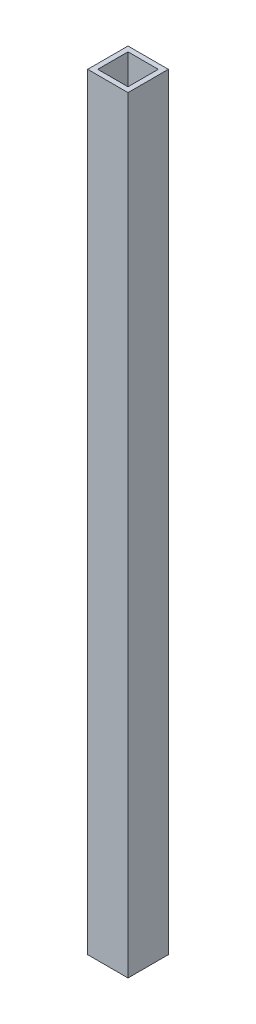
ISO-10303-21;
HEADER;
FILE_DESCRIPTION(('STEP AP214'),'2;1');
FILE_NAME('part.step','',(''),(''),'','','');
FILE_SCHEMA(('AUTOMOTIVE_DESIGN { 1 0 10303 214 1 1 1 1 }'));
ENDSEC;
DATA;
#1=APPLICATION_CONTEXT('core data for automotive mechanical design processes');
#2=APPLICATION_PROTOCOL_DEFINITION('international standard','automotive_design',2000,#1);
#3=PRODUCT_CONTEXT('',#1,'mechanical');
#4=PRODUCT('Part','Part','',(#3));
#5=PRODUCT_RELATED_PRODUCT_CATEGORY('part','',(#4));
#6=PRODUCT_DEFINITION_FORMATION('','',#4);
#7=PRODUCT_DEFINITION_CONTEXT('part definition',#1,'design');
#8=PRODUCT_DEFINITION('design','',#6,#7);
#9=PRODUCT_DEFINITION_SHAPE('','',#8);
#10=(LENGTH_UNIT() NAMED_UNIT(*) SI_UNIT(.MILLI.,.METRE.));
#11=(NAMED_UNIT(*) PLANE_ANGLE_UNIT() SI_UNIT($,.RADIAN.));
#12=(NAMED_UNIT(*) SI_UNIT($,.STERADIAN.) SOLID_ANGLE_UNIT());
#13=UNCERTAINTY_MEASURE_WITH_UNIT(LENGTH_MEASURE(1.E-05),#10,'distance_accuracy_value','');
#14=(GEOMETRIC_REPRESENTATION_CONTEXT(3) GLOBAL_UNCERTAINTY_ASSIGNED_CONTEXT((#13)) GLOBAL_UNIT_ASSIGNED_CONTEXT((#10,
#11,#12)) REPRESENTATION_CONTEXT('',''));
#15=CARTESIAN_POINT('',(0.,0.,0.));
#16=DIRECTION('',(0.,0.,1.));
#17=DIRECTION('',(1.,0.,0.));
#18=AXIS2_PLACEMENT_3D('',#15,#16,#17);
#19=CARTESIAN_POINT('',(-165.1,749.3,2104.59868564606));
#20=DIRECTION('',(-1.,0.,0.));
#21=DIRECTION('',(0.,0.,1.));
#22=AXIS2_PLACEMENT_3D('',#19,#20,#21);
#23=PLANE('',#22);
#24=DIRECTION('',(0.,0.,-1.));
#25=VECTOR('',#24,1.);
#26=CARTESIAN_POINT('',(-165.1,-215.9,2104.59868564606));
#27=LINE('',#26,#25);
#28=CARTESIAN_POINT('',(-165.1,-215.9,2133.6));
#29=VERTEX_POINT('',#28);
#30=CARTESIAN_POINT('',(-165.1,-215.9,2082.8));
#31=VERTEX_POINT('',#30);
#32=EDGE_CURVE('E155',#29,#31,#27,.T.);
#33=ORIENTED_EDGE('',*,*,#32,.T.);
#34=DIRECTION('',(0.,-1.,0.));
#35=VECTOR('',#34,1.);
#36=CARTESIAN_POINT('',(-165.1,749.3,2082.8));
#37=LINE('',#36,#35);
#38=CARTESIAN_POINT('',(-165.1,749.3,2082.8));
#39=VERTEX_POINT('',#38);
#40=EDGE_CURVE('E39',#39,#31,#37,.T.);
#41=ORIENTED_EDGE('',*,*,#40,.F.);
#42=DIRECTION('',(0.,0.,-1.));
#43=VECTOR('',#42,1.);
#44=CARTESIAN_POINT('',(-165.1,749.3,2104.59868564606));
#45=LINE('',#44,#43);
#46=CARTESIAN_POINT('',(-165.1,749.3,2133.6));
#47=VERTEX_POINT('',#46);
#48=EDGE_CURVE('E126',#47,#39,#45,.T.);
#49=ORIENTED_EDGE('',*,*,#48,.F.);
#50=DIRECTION('',(0.,-1.,0.));
#51=VECTOR('',#50,1.);
#52=CARTESIAN_POINT('',(-165.1,749.3,2133.6));
#53=LINE('',#52,#51);
#54=EDGE_CURVE('E9',#47,#29,#53,.T.);
#55=ORIENTED_EDGE('',*,*,#54,.T.);
#56=EDGE_LOOP('',(#33,#41,#49,#55));
#57=FACE_BOUND('',#56,.T.);
#58=ADVANCED_FACE('F14',(#57),#23,.F.);
#59=CARTESIAN_POINT('',(-190.5,749.3,2133.6));
#60=DIRECTION('',(0.,0.,-1.));
#61=DIRECTION('',(-1.,0.,0.));
#62=AXIS2_PLACEMENT_3D('',#59,#60,#61);
#63=PLANE('',#62);
#64=DIRECTION('',(1.,0.,0.));
#65=VECTOR('',#64,1.);
#66=CARTESIAN_POINT('',(-190.5,-215.9,2133.6));
#67=LINE('',#66,#65);
#68=CARTESIAN_POINT('',(-215.9,-215.9,2133.6));
#69=VERTEX_POINT('',#68);
#70=EDGE_CURVE('E158',#69,#29,#67,.T.);
#71=ORIENTED_EDGE('',*,*,#70,.T.);
#72=ORIENTED_EDGE('',*,*,#54,.F.);
#73=DIRECTION('',(1.,0.,0.));
#74=VECTOR('',#73,1.);
#75=CARTESIAN_POINT('',(-190.5,749.3,2133.6));
#76=LINE('',#75,#74);
#77=CARTESIAN_POINT('',(-215.9,749.3,2133.6));
#78=VERTEX_POINT('',#77);
#79=EDGE_CURVE('E121',#78,#47,#76,.T.);
#80=ORIENTED_EDGE('',*,*,#79,.F.);
#81=DIRECTION('',(0.,-1.,0.));
#82=VECTOR('',#81,1.);
#83=CARTESIAN_POINT('',(-215.9,749.3,2133.6));
#84=LINE('',#83,#82);
#85=EDGE_CURVE('E25',#78,#69,#84,.T.);
#86=ORIENTED_EDGE('',*,*,#85,.T.);
#87=EDGE_LOOP('',(#71,#72,#80,#86));
#88=FACE_BOUND('',#87,.T.);
#89=ADVANCED_FACE('F122',(#88),#63,.F.);
#90=CARTESIAN_POINT('',(-215.9,749.3,2104.59868564606));
#91=DIRECTION('',(1.,0.,0.));
#92=DIRECTION('',(0.,0.,-1.));
#93=AXIS2_PLACEMENT_3D('',#90,#91,#92);
#94=PLANE('',#93);
#95=DIRECTION('',(0.,0.,1.));
#96=VECTOR('',#95,1.);
#97=CARTESIAN_POINT('',(-215.9,-215.9,2104.59868564606));
#98=LINE('',#97,#96);
#99=CARTESIAN_POINT('',(-215.9,-215.9,2082.8));
#100=VERTEX_POINT('',#99);
#101=EDGE_CURVE('E114',#100,#69,#98,.T.);
#102=ORIENTED_EDGE('',*,*,#101,.T.);
#103=ORIENTED_EDGE('',*,*,#85,.F.);
#104=DIRECTION('',(0.,0.,1.));
#105=VECTOR('',#104,1.);
#106=CARTESIAN_POINT('',(-215.9,749.3,2104.59868564606));
#107=LINE('',#106,#105);
#108=CARTESIAN_POINT('',(-215.9,749.3,2082.8));
#109=VERTEX_POINT('',#108);
#110=EDGE_CURVE('E111',#109,#78,#107,.T.);
#111=ORIENTED_EDGE('',*,*,#110,.F.);
#112=DIRECTION('',(0.,-1.,0.));
#113=VECTOR('',#112,1.);
#114=CARTESIAN_POINT('',(-215.9,749.3,2082.8));
#115=LINE('',#114,#113);
#116=EDGE_CURVE('E75',#109,#100,#115,.T.);
#117=ORIENTED_EDGE('',*,*,#116,.T.);
#118=EDGE_LOOP('',(#102,#103,#111,#117));
#119=FACE_BOUND('',#118,.T.);
#120=ADVANCED_FACE('F109',(#119),#94,.F.);
#121=CARTESIAN_POINT('',(-188.197001087666,749.3,2089.15));
#122=DIRECTION('',(0.,0.,-1.));
#123=DIRECTION('',(-1.,0.,0.));
#124=AXIS2_PLACEMENT_3D('',#121,#122,#123);
#125=PLANE('',#124);
#126=DIRECTION('',(1.,0.,0.));
#127=VECTOR('',#126,1.);
#128=CARTESIAN_POINT('',(-188.197001087666,-215.9,2089.15));
#129=LINE('',#128,#127);
#130=CARTESIAN_POINT('',(-209.55,-215.9,2089.15));
#131=VERTEX_POINT('',#130);
#132=CARTESIAN_POINT('',(-171.45,-215.9,2089.15));
#133=VERTEX_POINT('',#132);
#134=EDGE_CURVE('E140',#131,#133,#129,.T.);
#135=ORIENTED_EDGE('',*,*,#134,.T.);
#136=DIRECTION('',(0.,-1.,0.));
#137=VECTOR('',#136,1.);
#138=CARTESIAN_POINT('',(-171.45,749.3,2089.15));
#139=LINE('',#138,#137);
#140=CARTESIAN_POINT('',(-171.45,749.3,2089.15));
#141=VERTEX_POINT('',#140);
#142=EDGE_CURVE('E136',#141,#133,#139,.T.);
#143=ORIENTED_EDGE('',*,*,#142,.F.);
#144=DIRECTION('',(1.,0.,0.));
#145=VECTOR('',#144,1.);
#146=CARTESIAN_POINT('',(-188.197001087666,749.3,2089.15));
#147=LINE('',#146,#145);
#148=CARTESIAN_POINT('',(-209.55,749.3,2089.15));
#149=VERTEX_POINT('',#148);
#150=EDGE_CURVE('E164',#149,#141,#147,.T.);
#151=ORIENTED_EDGE('',*,*,#150,.F.);
#152=DIRECTION('',(0.,-1.,0.));
#153=VECTOR('',#152,1.);
#154=CARTESIAN_POINT('',(-209.55,749.3,2089.15));
#155=LINE('',#154,#153);
#156=EDGE_CURVE('E18',#149,#131,#155,.T.);
#157=ORIENTED_EDGE('',*,*,#156,.T.);
#158=EDGE_LOOP('',(#135,#143,#151,#157));
#159=FACE_BOUND('',#158,.T.);
#160=ADVANCED_FACE('F16',(#159),#125,.F.);
#161=CARTESIAN_POINT('',(-209.55,749.3,2107.64241218567));
#162=DIRECTION('',(-1.,0.,0.));
#163=DIRECTION('',(0.,0.,1.));
#164=AXIS2_PLACEMENT_3D('',#161,#162,#163);
#165=PLANE('',#164);
#166=DIRECTION('',(0.,0.,-1.));
#167=VECTOR('',#166,1.);
#168=CARTESIAN_POINT('',(-209.55,-215.9,2107.64241218567));
#169=LINE('',#168,#167);
#170=CARTESIAN_POINT('',(-209.55,-215.9,2127.25));
#171=VERTEX_POINT('',#170);
#172=EDGE_CURVE('E144',#171,#131,#169,.T.);
#173=ORIENTED_EDGE('',*,*,#172,.T.);
#174=ORIENTED_EDGE('',*,*,#156,.F.);
#175=DIRECTION('',(0.,0.,-1.));
#176=VECTOR('',#175,1.);
#177=CARTESIAN_POINT('',(-209.55,749.3,2107.64241218567));
#178=LINE('',#177,#176);
#179=CARTESIAN_POINT('',(-209.55,749.3,2127.25));
#180=VERTEX_POINT('',#179);
#181=EDGE_CURVE('E200',#180,#149,#178,.T.);
#182=ORIENTED_EDGE('',*,*,#181,.F.);
#183=DIRECTION('',(0.,-1.,0.));
#184=VECTOR('',#183,1.);
#185=CARTESIAN_POINT('',(-209.55,749.3,2127.25));
#186=LINE('',#185,#184);
#187=EDGE_CURVE('E173',#180,#171,#186,.T.);
#188=ORIENTED_EDGE('',*,*,#187,.T.);
#189=EDGE_LOOP('',(#173,#174,#182,#188));
#190=FACE_BOUND('',#189,.T.);
#191=ADVANCED_FACE('F184',(#190),#165,.F.);
#192=CARTESIAN_POINT('',(-188.197001087666,749.3,2127.25));
#193=DIRECTION('',(0.,0.,-1.));
#194=DIRECTION('',(-1.,0.,0.));
#195=AXIS2_PLACEMENT_3D('',#192,#193,#194);
#196=PLANE('',#195);
#197=DIRECTION('',(1.,0.,0.));
#198=VECTOR('',#197,1.);
#199=CARTESIAN_POINT('',(-188.197001087666,-215.9,2127.25));
#200=LINE('',#199,#198);
#201=CARTESIAN_POINT('',(-171.45,-215.9,2127.25));
#202=VERTEX_POINT('',#201);
#203=EDGE_CURVE('E147',#171,#202,#200,.T.);
#204=ORIENTED_EDGE('',*,*,#203,.F.);
#205=ORIENTED_EDGE('',*,*,#187,.F.);
#206=DIRECTION('',(1.,0.,0.));
#207=VECTOR('',#206,1.);
#208=CARTESIAN_POINT('',(-188.197001087666,749.3,2127.25));
#209=LINE('',#208,#207);
#210=CARTESIAN_POINT('',(-171.45,749.3,2127.25));
#211=VERTEX_POINT('',#210);
#212=EDGE_CURVE('E198',#180,#211,#209,.T.);
#213=ORIENTED_EDGE('',*,*,#212,.T.);
#214=DIRECTION('',(0.,-1.,0.));
#215=VECTOR('',#214,1.);
#216=CARTESIAN_POINT('',(-171.45,749.3,2127.25));
#217=LINE('',#216,#215);
#218=EDGE_CURVE('E171',#211,#202,#217,.T.);
#219=ORIENTED_EDGE('',*,*,#218,.T.);
#220=EDGE_LOOP('',(#204,#205,#213,#219));
#221=FACE_BOUND('',#220,.T.);
#222=ADVANCED_FACE('F220',(#221),#196,.T.);
#223=CARTESIAN_POINT('',(-171.45,749.3,2107.64241218567));
#224=DIRECTION('',(-1.,0.,0.));
#225=DIRECTION('',(0.,0.,1.));
#226=AXIS2_PLACEMENT_3D('',#223,#224,#225);
#227=PLANE('',#226);
#228=DIRECTION('',(0.,0.,-1.));
#229=VECTOR('',#228,1.);
#230=CARTESIAN_POINT('',(-171.45,-215.9,2107.64241218567));
#231=LINE('',#230,#229);
#232=EDGE_CURVE('E151',#202,#133,#231,.T.);
#233=ORIENTED_EDGE('',*,*,#232,.F.);
#234=ORIENTED_EDGE('',*,*,#218,.F.);
#235=DIRECTION('',(0.,0.,-1.));
#236=VECTOR('',#235,1.);
#237=CARTESIAN_POINT('',(-171.45,749.3,2107.64241218567));
#238=LINE('',#237,#236);
#239=EDGE_CURVE('E194',#211,#141,#238,.T.);
#240=ORIENTED_EDGE('',*,*,#239,.T.);
#241=ORIENTED_EDGE('',*,*,#142,.T.);
#242=EDGE_LOOP('',(#233,#234,#240,#241));
#243=FACE_BOUND('',#242,.T.);
#244=ADVANCED_FACE('F190',(#243),#227,.T.);
#245=CARTESIAN_POINT('',(-190.5,749.3,2082.8));
#246=DIRECTION('',(0.,0.,-1.));
#247=DIRECTION('',(-1.,0.,0.));
#248=AXIS2_PLACEMENT_3D('',#245,#246,#247);
#249=PLANE('',#248);
#250=DIRECTION('',(1.,0.,0.));
#251=VECTOR('',#250,1.);
#252=CARTESIAN_POINT('',(-190.5,-215.9,2082.8));
#253=LINE('',#252,#251);
#254=EDGE_CURVE('E161',#100,#31,#253,.T.);
#255=ORIENTED_EDGE('',*,*,#254,.F.);
#256=ORIENTED_EDGE('',*,*,#116,.F.);
#257=DIRECTION('',(1.,0.,0.));
#258=VECTOR('',#257,1.);
#259=CARTESIAN_POINT('',(-190.5,749.3,2082.8));
#260=LINE('',#259,#258);
#261=EDGE_CURVE('E129',#109,#39,#260,.T.);
#262=ORIENTED_EDGE('',*,*,#261,.T.);
#263=ORIENTED_EDGE('',*,*,#40,.T.);
#264=EDGE_LOOP('',(#255,#256,#262,#263));
#265=FACE_BOUND('',#264,.T.);
#266=ADVANCED_FACE('F211',(#265),#249,.T.);
#267=CARTESIAN_POINT('',(-190.5,749.3,1066.8));
#268=DIRECTION('',(0.,-1.,0.));
#269=DIRECTION('',(1.,0.,0.));
#270=AXIS2_PLACEMENT_3D('',#267,#268,#269);
#271=PLANE('',#270);
#272=ORIENTED_EDGE('',*,*,#150,.T.);
#273=ORIENTED_EDGE('',*,*,#239,.F.);
#274=ORIENTED_EDGE('',*,*,#212,.F.);
#275=ORIENTED_EDGE('',*,*,#181,.T.);
#276=EDGE_LOOP('',(#272,#273,#274,#275));
#277=FACE_BOUND('',#276,.T.);
#278=ORIENTED_EDGE('',*,*,#48,.T.);
#279=ORIENTED_EDGE('',*,*,#261,.F.);
#280=ORIENTED_EDGE('',*,*,#110,.T.);
#281=ORIENTED_EDGE('',*,*,#79,.T.);
#282=EDGE_LOOP('',(#278,#279,#280,#281));
#283=FACE_BOUND('',#282,.T.);
#284=ADVANCED_FACE('F128',(#277,#283),#271,.F.);
#285=CARTESIAN_POINT('',(-190.5,-215.9,1066.8));
#286=DIRECTION('',(0.,-1.,0.));
#287=DIRECTION('',(1.,0.,0.));
#288=AXIS2_PLACEMENT_3D('',#285,#286,#287);
#289=PLANE('',#288);
#290=ORIENTED_EDGE('',*,*,#134,.F.);
#291=ORIENTED_EDGE('',*,*,#172,.F.);
#292=ORIENTED_EDGE('',*,*,#203,.T.);
#293=ORIENTED_EDGE('',*,*,#232,.T.);
#294=EDGE_LOOP('',(#290,#291,#292,#293));
#295=FACE_BOUND('',#294,.T.);
#296=ORIENTED_EDGE('',*,*,#32,.F.);
#297=ORIENTED_EDGE('',*,*,#70,.F.);
#298=ORIENTED_EDGE('',*,*,#101,.F.);
#299=ORIENTED_EDGE('',*,*,#254,.T.);
#300=EDGE_LOOP('',(#296,#297,#298,#299));
#301=FACE_BOUND('',#300,.T.);
#302=ADVANCED_FACE('F186',(#295,#301),#289,.T.);
#303=CLOSED_SHELL('',(#58,#89,#120,#160,#191,#222,#244,#266,#284,#302));
#304=MANIFOLD_SOLID_BREP('B1',#303);
#305=ADVANCED_BREP_SHAPE_REPRESENTATION('',(#18,#304),#14);
#306=SHAPE_DEFINITION_REPRESENTATION(#9,#305);
ENDSEC;
END-ISO-10303-21;
